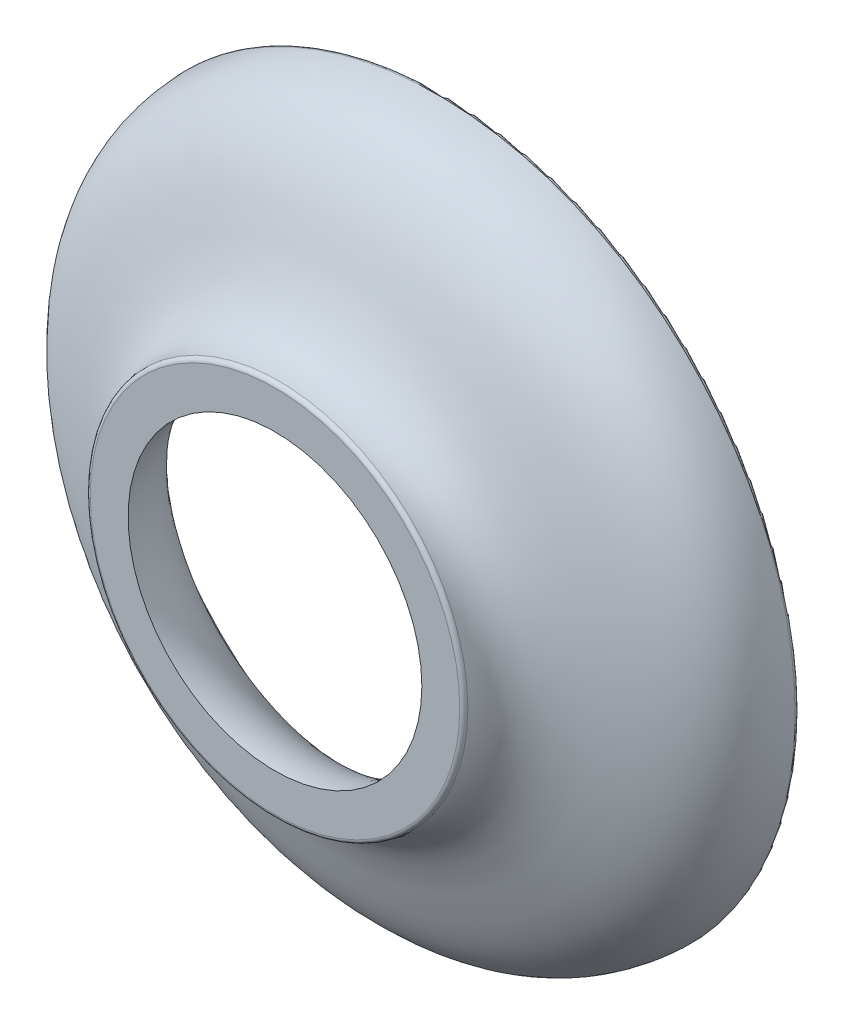
ISO-10303-21;
HEADER;
FILE_DESCRIPTION(('STEP AP214'),'2;1');
FILE_NAME('part.step','',(''),(''),'','','');
FILE_SCHEMA(('AUTOMOTIVE_DESIGN { 1 0 10303 214 1 1 1 1 }'));
ENDSEC;
DATA;
#1=APPLICATION_CONTEXT('core data for automotive mechanical design processes');
#2=APPLICATION_PROTOCOL_DEFINITION('international standard','automotive_design',2000,#1);
#3=PRODUCT_CONTEXT('',#1,'mechanical');
#4=PRODUCT('Part','Part','',(#3));
#5=PRODUCT_RELATED_PRODUCT_CATEGORY('part','',(#4));
#6=PRODUCT_DEFINITION_FORMATION('','',#4);
#7=PRODUCT_DEFINITION_CONTEXT('part definition',#1,'design');
#8=PRODUCT_DEFINITION('design','',#6,#7);
#9=PRODUCT_DEFINITION_SHAPE('','',#8);
#10=(LENGTH_UNIT() NAMED_UNIT(*) SI_UNIT(.MILLI.,.METRE.));
#11=(NAMED_UNIT(*) PLANE_ANGLE_UNIT() SI_UNIT($,.RADIAN.));
#12=(NAMED_UNIT(*) SI_UNIT($,.STERADIAN.) SOLID_ANGLE_UNIT());
#13=UNCERTAINTY_MEASURE_WITH_UNIT(LENGTH_MEASURE(1.E-05),#10,'distance_accuracy_value','');
#14=(GEOMETRIC_REPRESENTATION_CONTEXT(3) GLOBAL_UNCERTAINTY_ASSIGNED_CONTEXT((#13)) GLOBAL_UNIT_ASSIGNED_CONTEXT((#10,
#11,#12)) REPRESENTATION_CONTEXT('',''));
#15=CARTESIAN_POINT('',(0.,0.,0.));
#16=DIRECTION('',(0.,0.,1.));
#17=DIRECTION('',(1.,0.,0.));
#18=AXIS2_PLACEMENT_3D('',#15,#16,#17);
#19=CARTESIAN_POINT('',(-11.0080265945127,-17.3744764167866,25.2010965279296));
#20=DIRECTION('',(0.,0.,1.));
#21=DIRECTION('',(1.,0.,0.));
#22=AXIS2_PLACEMENT_3D('',#19,#20,#21);
#23=PLANE('',#22);
#24=CARTESIAN_POINT('',(-1.83632370109541,-7.9482036215942,25.2010965279296));
#25=DIRECTION('',(0.,0.,1.));
#26=DIRECTION('',(1.,0.,0.));
#27=AXIS2_PLACEMENT_3D('',#24,#25,#26);
#28=CIRCLE('',#27,8.39817044259434);
#29=CARTESIAN_POINT('',(6.56184674149892,-7.9482036215942,25.2010965279296));
#30=VERTEX_POINT('',#29);
#31=EDGE_CURVE('E10',#30,#30,#28,.F.);
#32=ORIENTED_EDGE('',*,*,#31,.T.);
#33=EDGE_LOOP('',(#32));
#34=FACE_BOUND('',#33,.T.);
#35=CARTESIAN_POINT('',(-1.83632370109541,-7.9482036215942,25.2010965279296));
#36=DIRECTION('',(0.,0.,1.));
#37=DIRECTION('',(1.,0.,0.));
#38=AXIS2_PLACEMENT_3D('',#35,#36,#37);
#39=CIRCLE('',#38,7.5);
#40=CARTESIAN_POINT('',(5.66367629890458,-7.9482036215942,25.2010965279296));
#41=VERTEX_POINT('',#40);
#42=EDGE_CURVE('E30',#41,#41,#39,.T.);
#43=ORIENTED_EDGE('',*,*,#42,.T.);
#44=EDGE_LOOP('',(#43));
#45=FACE_BOUND('',#44,.T.);
#46=ADVANCED_FACE('F15',(#34,#45),#23,.F.);
#47=CARTESIAN_POINT('',(-1.83632370109541,-7.9482036215942,29.1010965279297));
#48=DIRECTION('',(0.,0.,1.));
#49=DIRECTION('',(1.,0.,0.));
#50=AXIS2_PLACEMENT_3D('',#47,#48,#49);
#51=TOROIDAL_SURFACE('',#50,4.40315125537648,0.1);
#52=CARTESIAN_POINT('',(-1.83632370109541,-7.9482036215942,29.1074914156458));
#53=DIRECTION('',(0.,0.,1.));
#54=DIRECTION('',(1.,0.,0.));
#55=AXIS2_PLACEMENT_3D('',#52,#53,#54);
#56=CIRCLE('',#55,4.50294657295752);
#57=CARTESIAN_POINT('',(2.6666228718621,-7.9482036215942,29.1074914156458));
#58=VERTEX_POINT('',#57);
#59=EDGE_CURVE('E35',#58,#58,#56,.F.);
#60=ORIENTED_EDGE('',*,*,#59,.F.);
#61=EDGE_LOOP('',(#60));
#62=FACE_BOUND('',#61,.T.);
#63=CARTESIAN_POINT('',(-1.83632370109541,-7.9482036215942,29.2010965279296));
#64=DIRECTION('',(0.,0.,-1.));
#65=DIRECTION('',(-1.,0.,0.));
#66=AXIS2_PLACEMENT_3D('',#63,#64,#65);
#67=CIRCLE('',#66,4.40315125537648);
#68=CARTESIAN_POINT('',(-6.2394749564719,-7.9482036215942,29.2010965279296));
#69=VERTEX_POINT('',#68);
#70=EDGE_CURVE('E41',#69,#69,#67,.F.);
#71=ORIENTED_EDGE('',*,*,#70,.F.);
#72=EDGE_LOOP('',(#71));
#73=FACE_BOUND('',#72,.T.);
#74=ADVANCED_FACE('F59',(#62,#73),#51,.T.);
#75=CARTESIAN_POINT('',(-7.63158480297908,-7.9482036215942,23.2010965279297));
#76=CARTESIAN_POINT('',(-8.33983185359641,-7.9482036215942,23.2010965279297));
#77=CARTESIAN_POINT('',(-10.4254749152642,-7.9482036215942,23.289159495819));
#78=CARTESIAN_POINT('',(-10.2677189319793,-7.9482036215942,28.0467017540626));
#79=CARTESIAN_POINT('',(-6.33632370109542,-7.9482036215942,27.3598275260155));
#80=CARTESIAN_POINT('',(-6.33632370109541,-7.9482036215942,29.2010965279296));
#81=B_SPLINE_CURVE_WITH_KNOTS('',3,(#75,#76,#77,#78,#79,#80),.UNSPECIFIED.,.F.,.F.,(4,1,1,4),
(0.,0.37444393430255,0.47444393430255,1.),.UNSPECIFIED.);
#82=CARTESIAN_POINT('',(-1.83632370109541,-7.9482036215942,29.2010965279296));
#83=DIRECTION('',(0.,0.,1.));
#84=AXIS1_PLACEMENT('',#82,#83);
#85=SURFACE_OF_REVOLUTION('',#81,#84);
#86=CARTESIAN_POINT('',(-1.83632370109541,-7.9482036215942,25.3047491159345));
#87=DIRECTION('',(0.,0.,1.));
#88=DIRECTION('',(1.,0.,0.));
#89=AXIS2_PLACEMENT_3D('',#86,#87,#88);
#90=CIRCLE('',#89,8.49810371333471);
#91=CARTESIAN_POINT('',(6.66178001223929,-7.9482036215942,25.3047491159345));
#92=VERTEX_POINT('',#91);
#93=EDGE_CURVE('E23',#92,#92,#90,.T.);
#94=ORIENTED_EDGE('',*,*,#93,.T.);
#95=EDGE_LOOP('',(#94));
#96=FACE_BOUND('',#95,.T.);
#97=ORIENTED_EDGE('',*,*,#59,.T.);
#98=EDGE_LOOP('',(#97));
#99=FACE_BOUND('',#98,.T.);
#100=ADVANCED_FACE('F53',(#96,#99),#85,.T.);
#101=CARTESIAN_POINT('',(-1.83632370109541,-7.9482036215942,29.2010965279296));
#102=DIRECTION('',(0.,0.,-1.));
#103=DIRECTION('',(-1.,0.,0.));
#104=AXIS2_PLACEMENT_3D('',#101,#102,#103);
#105=PLANE('',#104);
#106=ORIENTED_EDGE('',*,*,#70,.T.);
#107=EDGE_LOOP('',(#106));
#108=FACE_BOUND('',#107,.T.);
#109=CARTESIAN_POINT('',(-1.83632370109541,-7.9482036215942,29.2010965279296));
#110=DIRECTION('',(0.,0.,1.));
#111=DIRECTION('',(1.,0.,0.));
#112=AXIS2_PLACEMENT_3D('',#109,#110,#111);
#113=CIRCLE('',#112,3.5);
#114=CARTESIAN_POINT('',(1.66367629890459,-7.9482036215942,29.2010965279296));
#115=VERTEX_POINT('',#114);
#116=EDGE_CURVE('E44',#115,#115,#113,.T.);
#117=ORIENTED_EDGE('',*,*,#116,.F.);
#118=EDGE_LOOP('',(#117));
#119=FACE_BOUND('',#118,.T.);
#120=ADVANCED_FACE('F58',(#108,#119),#105,.F.);
#121=CARTESIAN_POINT('',(-7.63158480297908,-7.9482036215942,23.2010965279297));
#122=CARTESIAN_POINT('',(-8.33983185359641,-7.9482036215942,23.2010965279297));
#123=CARTESIAN_POINT('',(-10.4254749152642,-7.9482036215942,23.289159495819));
#124=CARTESIAN_POINT('',(-10.2677189319793,-7.9482036215942,28.0467017540626));
#125=CARTESIAN_POINT('',(-6.33632370109542,-7.9482036215942,27.3598275260155));
#126=CARTESIAN_POINT('',(-6.33632370109541,-7.9482036215942,29.2010965279296));
#127=B_SPLINE_CURVE_WITH_KNOTS('',3,(#121,#122,#123,#124,#125,#126),.UNSPECIFIED.,.F.,.F.,(4,1,
1,4),(0.,0.37444393430255,0.47444393430255,1.),.UNSPECIFIED.);
#128=CARTESIAN_POINT('',(-1.83632370109541,-7.9482036215942,29.2010965279296));
#129=DIRECTION('',(0.,0.,1.));
#130=AXIS1_PLACEMENT('',#128,#129);
#131=SURFACE_OF_REVOLUTION('',#127,#130);
#132=OFFSET_SURFACE('',#131,-1.,.F.);
#133=ORIENTED_EDGE('',*,*,#42,.F.);
#134=EDGE_LOOP('',(#133));
#135=FACE_BOUND('',#134,.T.);
#136=ORIENTED_EDGE('',*,*,#116,.T.);
#137=EDGE_LOOP('',(#136));
#138=FACE_BOUND('',#137,.T.);
#139=ADVANCED_FACE('F60',(#135,#138),#132,.F.);
#140=CARTESIAN_POINT('',(-1.83632370109541,-7.9482036215942,25.3010965279297));
#141=DIRECTION('',(0.,0.,1.));
#142=DIRECTION('',(1.,0.,0.));
#143=AXIS2_PLACEMENT_3D('',#140,#141,#142);
#144=TOROIDAL_SURFACE('',#143,8.39817044259434,0.1);
#145=ORIENTED_EDGE('',*,*,#31,.F.);
#146=EDGE_LOOP('',(#145));
#147=FACE_BOUND('',#146,.T.);
#148=ORIENTED_EDGE('',*,*,#93,.F.);
#149=EDGE_LOOP('',(#148));
#150=FACE_BOUND('',#149,.T.);
#151=ADVANCED_FACE('F17',(#147,#150),#144,.T.);
#152=CLOSED_SHELL('',(#46,#74,#100,#120,#139,#151));
#153=MANIFOLD_SOLID_BREP('B1',#152);
#154=ADVANCED_BREP_SHAPE_REPRESENTATION('',(#18,#153),#14);
#155=SHAPE_DEFINITION_REPRESENTATION(#9,#154);
ENDSEC;
END-ISO-10303-21;
